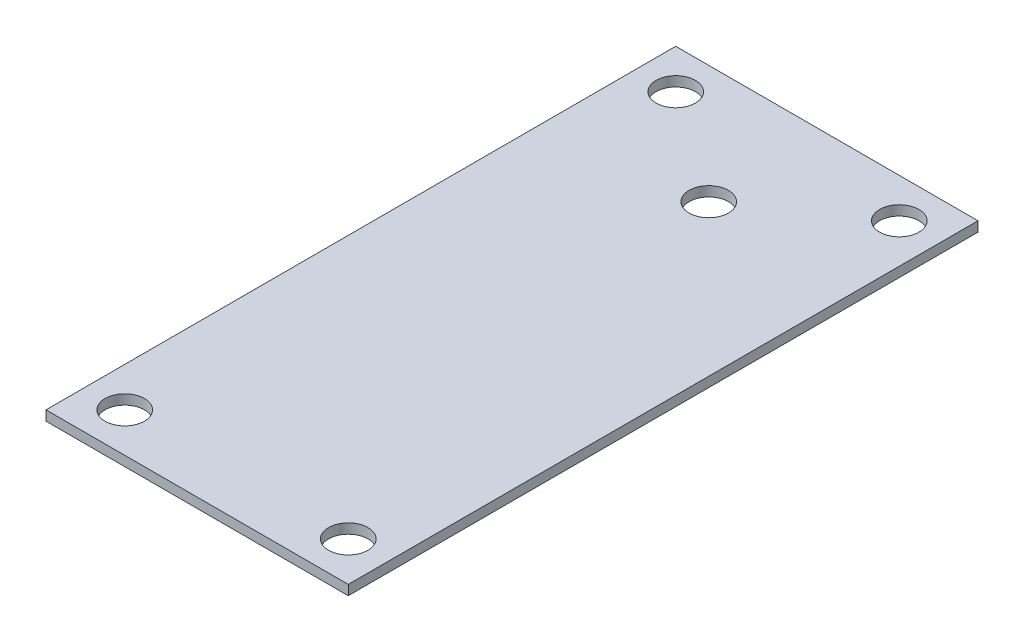
ISO-10303-21;
HEADER;
FILE_DESCRIPTION(('STEP AP214'),'2;1');
FILE_NAME('part.step','',(''),(''),'','','');
FILE_SCHEMA(('AUTOMOTIVE_DESIGN { 1 0 10303 214 1 1 1 1 }'));
ENDSEC;
DATA;
#1=APPLICATION_CONTEXT('core data for automotive mechanical design processes');
#2=APPLICATION_PROTOCOL_DEFINITION('international standard','automotive_design',2000,#1);
#3=PRODUCT_CONTEXT('',#1,'mechanical');
#4=PRODUCT('Part','Part','',(#3));
#5=PRODUCT_RELATED_PRODUCT_CATEGORY('part','',(#4));
#6=PRODUCT_DEFINITION_FORMATION('','',#4);
#7=PRODUCT_DEFINITION_CONTEXT('part definition',#1,'design');
#8=PRODUCT_DEFINITION('design','',#6,#7);
#9=PRODUCT_DEFINITION_SHAPE('','',#8);
#10=(LENGTH_UNIT() NAMED_UNIT(*) SI_UNIT(.MILLI.,.METRE.));
#11=(NAMED_UNIT(*) PLANE_ANGLE_UNIT() SI_UNIT($,.RADIAN.));
#12=(NAMED_UNIT(*) SI_UNIT($,.STERADIAN.) SOLID_ANGLE_UNIT());
#13=UNCERTAINTY_MEASURE_WITH_UNIT(LENGTH_MEASURE(1.E-05),#10,'distance_accuracy_value','');
#14=(GEOMETRIC_REPRESENTATION_CONTEXT(3) GLOBAL_UNCERTAINTY_ASSIGNED_CONTEXT((#13)) GLOBAL_UNIT_ASSIGNED_CONTEXT((#10,
#11,#12)) REPRESENTATION_CONTEXT('',''));
#15=CARTESIAN_POINT('',(0.,0.,0.));
#16=DIRECTION('',(0.,0.,1.));
#17=DIRECTION('',(1.,0.,0.));
#18=AXIS2_PLACEMENT_3D('',#15,#16,#17);
#19=CARTESIAN_POINT('',(0.,1.5875,-50.8));
#20=DIRECTION('',(0.,0.,-1.));
#21=DIRECTION('',(-1.,0.,0.));
#22=AXIS2_PLACEMENT_3D('',#19,#20,#21);
#23=PLANE('',#22);
#24=DIRECTION('',(1.,0.,0.));
#25=VECTOR('',#24,1.);
#26=CARTESIAN_POINT('',(0.,0.,-50.8));
#27=LINE('',#26,#25);
#28=CARTESIAN_POINT('',(-24.384,0.,-50.8));
#29=VERTEX_POINT('',#28);
#30=CARTESIAN_POINT('',(24.384,0.,-50.8));
#31=VERTEX_POINT('',#30);
#32=EDGE_CURVE('E116',#29,#31,#27,.T.);
#33=ORIENTED_EDGE('',*,*,#32,.F.);
#34=DIRECTION('',(0.,-1.,0.));
#35=VECTOR('',#34,1.);
#36=CARTESIAN_POINT('',(-24.384,1.5875,-50.8));
#37=LINE('',#36,#35);
#38=CARTESIAN_POINT('',(-24.384,1.5875,-50.8));
#39=VERTEX_POINT('',#38);
#40=EDGE_CURVE('E74',#39,#29,#37,.T.);
#41=ORIENTED_EDGE('',*,*,#40,.F.);
#42=DIRECTION('',(1.,0.,0.));
#43=VECTOR('',#42,1.);
#44=CARTESIAN_POINT('',(0.,1.5875,-50.8));
#45=LINE('',#44,#43);
#46=CARTESIAN_POINT('',(24.384,1.5875,-50.8));
#47=VERTEX_POINT('',#46);
#48=EDGE_CURVE('E114',#39,#47,#45,.T.);
#49=ORIENTED_EDGE('',*,*,#48,.T.);
#50=DIRECTION('',(0.,-1.,0.));
#51=VECTOR('',#50,1.);
#52=CARTESIAN_POINT('',(24.384,1.5875,-50.8));
#53=LINE('',#52,#51);
#54=EDGE_CURVE('E12',#47,#31,#53,.T.);
#55=ORIENTED_EDGE('',*,*,#54,.T.);
#56=EDGE_LOOP('',(#33,#41,#49,#55));
#57=FACE_BOUND('',#56,.T.);
#58=ADVANCED_FACE('F65',(#57),#23,.T.);
#59=CARTESIAN_POINT('',(-24.384,1.5875,0.));
#60=DIRECTION('',(1.,0.,0.));
#61=DIRECTION('',(0.,0.,-1.));
#62=AXIS2_PLACEMENT_3D('',#59,#60,#61);
#63=PLANE('',#62);
#64=DIRECTION('',(0.,0.,1.));
#65=VECTOR('',#64,1.);
#66=CARTESIAN_POINT('',(-24.384,0.,0.));
#67=LINE('',#66,#65);
#68=CARTESIAN_POINT('',(-24.384,0.,50.8));
#69=VERTEX_POINT('',#68);
#70=EDGE_CURVE('E148',#29,#69,#67,.T.);
#71=ORIENTED_EDGE('',*,*,#70,.T.);
#72=DIRECTION('',(0.,-1.,0.));
#73=VECTOR('',#72,1.);
#74=CARTESIAN_POINT('',(-24.384,1.5875,50.8));
#75=LINE('',#74,#73);
#76=CARTESIAN_POINT('',(-24.384,1.5875,50.8));
#77=VERTEX_POINT('',#76);
#78=EDGE_CURVE('E119',#77,#69,#75,.T.);
#79=ORIENTED_EDGE('',*,*,#78,.F.);
#80=DIRECTION('',(0.,0.,1.));
#81=VECTOR('',#80,1.);
#82=CARTESIAN_POINT('',(-24.384,1.5875,0.));
#83=LINE('',#82,#81);
#84=EDGE_CURVE('E121',#39,#77,#83,.T.);
#85=ORIENTED_EDGE('',*,*,#84,.F.);
#86=ORIENTED_EDGE('',*,*,#40,.T.);
#87=EDGE_LOOP('',(#71,#79,#85,#86));
#88=FACE_BOUND('',#87,.T.);
#89=ADVANCED_FACE('F122',(#88),#63,.F.);
#90=CARTESIAN_POINT('',(0.,1.5875,50.8));
#91=DIRECTION('',(0.,0.,-1.));
#92=DIRECTION('',(-1.,0.,0.));
#93=AXIS2_PLACEMENT_3D('',#90,#91,#92);
#94=PLANE('',#93);
#95=DIRECTION('',(1.,0.,0.));
#96=VECTOR('',#95,1.);
#97=CARTESIAN_POINT('',(0.,0.,50.8));
#98=LINE('',#97,#96);
#99=CARTESIAN_POINT('',(24.384,0.,50.8));
#100=VERTEX_POINT('',#99);
#101=EDGE_CURVE('E98',#69,#100,#98,.T.);
#102=ORIENTED_EDGE('',*,*,#101,.T.);
#103=DIRECTION('',(0.,-1.,0.));
#104=VECTOR('',#103,1.);
#105=CARTESIAN_POINT('',(24.384,1.5875,50.8));
#106=LINE('',#105,#104);
#107=CARTESIAN_POINT('',(24.384,1.5875,50.8));
#108=VERTEX_POINT('',#107);
#109=EDGE_CURVE('E105',#108,#100,#106,.T.);
#110=ORIENTED_EDGE('',*,*,#109,.F.);
#111=DIRECTION('',(1.,0.,0.));
#112=VECTOR('',#111,1.);
#113=CARTESIAN_POINT('',(0.,1.5875,50.8));
#114=LINE('',#113,#112);
#115=EDGE_CURVE('E82',#77,#108,#114,.T.);
#116=ORIENTED_EDGE('',*,*,#115,.F.);
#117=ORIENTED_EDGE('',*,*,#78,.T.);
#118=EDGE_LOOP('',(#102,#110,#116,#117));
#119=FACE_BOUND('',#118,.T.);
#120=ADVANCED_FACE('F154',(#119),#94,.F.);
#121=CARTESIAN_POINT('',(24.384,1.5875,0.));
#122=DIRECTION('',(1.,0.,0.));
#123=DIRECTION('',(0.,0.,-1.));
#124=AXIS2_PLACEMENT_3D('',#121,#122,#123);
#125=PLANE('',#124);
#126=DIRECTION('',(0.,0.,1.));
#127=VECTOR('',#126,1.);
#128=CARTESIAN_POINT('',(24.384,0.,0.));
#129=LINE('',#128,#127);
#130=EDGE_CURVE('E145',#31,#100,#129,.T.);
#131=ORIENTED_EDGE('',*,*,#130,.F.);
#132=ORIENTED_EDGE('',*,*,#54,.F.);
#133=DIRECTION('',(0.,0.,1.));
#134=VECTOR('',#133,1.);
#135=CARTESIAN_POINT('',(24.384,1.5875,0.));
#136=LINE('',#135,#134);
#137=EDGE_CURVE('E125',#47,#108,#136,.T.);
#138=ORIENTED_EDGE('',*,*,#137,.T.);
#139=ORIENTED_EDGE('',*,*,#109,.T.);
#140=EDGE_LOOP('',(#131,#132,#138,#139));
#141=FACE_BOUND('',#140,.T.);
#142=ADVANCED_FACE('F156',(#141),#125,.T.);
#143=CARTESIAN_POINT('',(-18.034,1.5875,-44.45));
#144=DIRECTION('',(0.,-1.,0.));
#145=DIRECTION('',(0.,0.,-1.));
#146=AXIS2_PLACEMENT_3D('',#143,#144,#145);
#147=CYLINDRICAL_SURFACE('',#146,3.175);
#148=CARTESIAN_POINT('',(-18.034,1.5875,-44.45));
#149=DIRECTION('',(0.,1.,0.));
#150=DIRECTION('',(0.,0.,1.));
#151=AXIS2_PLACEMENT_3D('',#148,#149,#150);
#152=CIRCLE('',#151,3.175);
#153=CARTESIAN_POINT('',(-18.034,1.5875,-41.275));
#154=VERTEX_POINT('',#153);
#155=EDGE_CURVE('E127',#154,#154,#152,.T.);
#156=ORIENTED_EDGE('',*,*,#155,.T.);
#157=EDGE_LOOP('',(#156));
#158=FACE_BOUND('',#157,.T.);
#159=CARTESIAN_POINT('',(-18.034,0.,-44.45));
#160=DIRECTION('',(0.,1.,0.));
#161=DIRECTION('',(0.,0.,1.));
#162=AXIS2_PLACEMENT_3D('',#159,#160,#161);
#163=CIRCLE('',#162,3.175);
#164=CARTESIAN_POINT('',(-18.034,0.,-41.275));
#165=VERTEX_POINT('',#164);
#166=EDGE_CURVE('E142',#165,#165,#163,.T.);
#167=ORIENTED_EDGE('',*,*,#166,.F.);
#168=EDGE_LOOP('',(#167));
#169=FACE_BOUND('',#168,.T.);
#170=ADVANCED_FACE('F158',(#158,#169),#147,.F.);
#171=CARTESIAN_POINT('',(18.034,1.5875,-44.45));
#172=DIRECTION('',(0.,-1.,0.));
#173=DIRECTION('',(0.,0.,-1.));
#174=AXIS2_PLACEMENT_3D('',#171,#172,#173);
#175=CYLINDRICAL_SURFACE('',#174,3.175);
#176=CARTESIAN_POINT('',(18.034,1.5875,-44.45));
#177=DIRECTION('',(0.,1.,0.));
#178=DIRECTION('',(0.,0.,1.));
#179=AXIS2_PLACEMENT_3D('',#176,#177,#178);
#180=CIRCLE('',#179,3.175);
#181=CARTESIAN_POINT('',(18.034,1.5875,-41.275));
#182=VERTEX_POINT('',#181);
#183=EDGE_CURVE('E200',#182,#182,#180,.T.);
#184=ORIENTED_EDGE('',*,*,#183,.T.);
#185=EDGE_LOOP('',(#184));
#186=FACE_BOUND('',#185,.T.);
#187=CARTESIAN_POINT('',(18.034,0.,-44.45));
#188=DIRECTION('',(0.,1.,0.));
#189=DIRECTION('',(0.,0.,1.));
#190=AXIS2_PLACEMENT_3D('',#187,#188,#189);
#191=CIRCLE('',#190,3.175);
#192=CARTESIAN_POINT('',(18.034,0.,-41.275));
#193=VERTEX_POINT('',#192);
#194=EDGE_CURVE('E139',#193,#193,#191,.T.);
#195=ORIENTED_EDGE('',*,*,#194,.F.);
#196=EDGE_LOOP('',(#195));
#197=FACE_BOUND('',#196,.T.);
#198=ADVANCED_FACE('F164',(#186,#197),#175,.F.);
#199=CARTESIAN_POINT('',(18.034,1.5875,44.45));
#200=DIRECTION('',(0.,-1.,0.));
#201=DIRECTION('',(0.,0.,-1.));
#202=AXIS2_PLACEMENT_3D('',#199,#200,#201);
#203=CYLINDRICAL_SURFACE('',#202,3.175);
#204=CARTESIAN_POINT('',(18.034,1.5875,44.45));
#205=DIRECTION('',(0.,1.,0.));
#206=DIRECTION('',(0.,0.,1.));
#207=AXIS2_PLACEMENT_3D('',#204,#205,#206);
#208=CIRCLE('',#207,3.175);
#209=CARTESIAN_POINT('',(18.034,1.5875,47.625));
#210=VERTEX_POINT('',#209);
#211=EDGE_CURVE('E197',#210,#210,#208,.T.);
#212=ORIENTED_EDGE('',*,*,#211,.T.);
#213=EDGE_LOOP('',(#212));
#214=FACE_BOUND('',#213,.T.);
#215=CARTESIAN_POINT('',(18.034,0.,44.45));
#216=DIRECTION('',(0.,1.,0.));
#217=DIRECTION('',(0.,0.,1.));
#218=AXIS2_PLACEMENT_3D('',#215,#216,#217);
#219=CIRCLE('',#218,3.175);
#220=CARTESIAN_POINT('',(18.034,0.,47.625));
#221=VERTEX_POINT('',#220);
#222=EDGE_CURVE('E135',#221,#221,#219,.T.);
#223=ORIENTED_EDGE('',*,*,#222,.F.);
#224=EDGE_LOOP('',(#223));
#225=FACE_BOUND('',#224,.T.);
#226=ADVANCED_FACE('F213',(#214,#225),#203,.F.);
#227=CARTESIAN_POINT('',(-18.034,1.5875,44.45));
#228=DIRECTION('',(0.,-1.,0.));
#229=DIRECTION('',(0.,0.,-1.));
#230=AXIS2_PLACEMENT_3D('',#227,#228,#229);
#231=CYLINDRICAL_SURFACE('',#230,3.175);
#232=CARTESIAN_POINT('',(-18.034,1.5875,44.45));
#233=DIRECTION('',(0.,1.,0.));
#234=DIRECTION('',(0.,0.,1.));
#235=AXIS2_PLACEMENT_3D('',#232,#233,#234);
#236=CIRCLE('',#235,3.175);
#237=CARTESIAN_POINT('',(-18.034,1.5875,47.625));
#238=VERTEX_POINT('',#237);
#239=EDGE_CURVE('E151',#238,#238,#236,.T.);
#240=ORIENTED_EDGE('',*,*,#239,.T.);
#241=EDGE_LOOP('',(#240));
#242=FACE_BOUND('',#241,.T.);
#243=CARTESIAN_POINT('',(-18.034,0.,44.45));
#244=DIRECTION('',(0.,1.,0.));
#245=DIRECTION('',(0.,0.,1.));
#246=AXIS2_PLACEMENT_3D('',#243,#244,#245);
#247=CIRCLE('',#246,3.175);
#248=CARTESIAN_POINT('',(-18.034,0.,47.625));
#249=VERTEX_POINT('',#248);
#250=EDGE_CURVE('E132',#249,#249,#247,.T.);
#251=ORIENTED_EDGE('',*,*,#250,.F.);
#252=EDGE_LOOP('',(#251));
#253=FACE_BOUND('',#252,.T.);
#254=ADVANCED_FACE('F67',(#242,#253),#231,.F.);
#255=CARTESIAN_POINT('',(0.,0.,0.));
#256=DIRECTION('',(0.,1.,0.));
#257=DIRECTION('',(0.,0.,1.));
#258=AXIS2_PLACEMENT_3D('',#255,#256,#257);
#259=PLANE('',#258);
#260=CARTESIAN_POINT('',(0.,0.,-31.75));
#261=DIRECTION('',(0.,1.,0.));
#262=DIRECTION('',(0.,0.,1.));
#263=AXIS2_PLACEMENT_3D('',#260,#261,#262);
#264=CIRCLE('',#263,3.175);
#265=CARTESIAN_POINT('',(0.,0.,-28.575));
#266=VERTEX_POINT('',#265);
#267=EDGE_CURVE('E136',#266,#266,#264,.F.);
#268=ORIENTED_EDGE('',*,*,#267,.F.);
#269=EDGE_LOOP('',(#268));
#270=FACE_BOUND('',#269,.T.);
#271=ORIENTED_EDGE('',*,*,#250,.T.);
#272=EDGE_LOOP('',(#271));
#273=FACE_BOUND('',#272,.T.);
#274=ORIENTED_EDGE('',*,*,#222,.T.);
#275=EDGE_LOOP('',(#274));
#276=FACE_BOUND('',#275,.T.);
#277=ORIENTED_EDGE('',*,*,#194,.T.);
#278=EDGE_LOOP('',(#277));
#279=FACE_BOUND('',#278,.T.);
#280=ORIENTED_EDGE('',*,*,#166,.T.);
#281=EDGE_LOOP('',(#280));
#282=FACE_BOUND('',#281,.T.);
#283=ORIENTED_EDGE('',*,*,#130,.T.);
#284=ORIENTED_EDGE('',*,*,#101,.F.);
#285=ORIENTED_EDGE('',*,*,#70,.F.);
#286=ORIENTED_EDGE('',*,*,#32,.T.);
#287=EDGE_LOOP('',(#283,#284,#285,#286));
#288=FACE_BOUND('',#287,.T.);
#289=ADVANCED_FACE('F155',(#270,#273,#276,#279,#282,#288),#259,.F.);
#290=CARTESIAN_POINT('',(0.,1.5875,0.));
#291=DIRECTION('',(0.,1.,0.));
#292=DIRECTION('',(0.,0.,1.));
#293=AXIS2_PLACEMENT_3D('',#290,#291,#292);
#294=PLANE('',#293);
#295=CARTESIAN_POINT('',(0.,1.5875,-31.75));
#296=DIRECTION('',(0.,1.,0.));
#297=DIRECTION('',(0.,0.,1.));
#298=AXIS2_PLACEMENT_3D('',#295,#296,#297);
#299=CIRCLE('',#298,3.175);
#300=CARTESIAN_POINT('',(0.,1.5875,-28.575));
#301=VERTEX_POINT('',#300);
#302=EDGE_CURVE('E189',#301,#301,#299,.T.);
#303=ORIENTED_EDGE('',*,*,#302,.F.);
#304=EDGE_LOOP('',(#303));
#305=FACE_BOUND('',#304,.T.);
#306=ORIENTED_EDGE('',*,*,#239,.F.);
#307=EDGE_LOOP('',(#306));
#308=FACE_BOUND('',#307,.T.);
#309=ORIENTED_EDGE('',*,*,#211,.F.);
#310=EDGE_LOOP('',(#309));
#311=FACE_BOUND('',#310,.T.);
#312=ORIENTED_EDGE('',*,*,#183,.F.);
#313=EDGE_LOOP('',(#312));
#314=FACE_BOUND('',#313,.T.);
#315=ORIENTED_EDGE('',*,*,#155,.F.);
#316=EDGE_LOOP('',(#315));
#317=FACE_BOUND('',#316,.T.);
#318=ORIENTED_EDGE('',*,*,#137,.F.);
#319=ORIENTED_EDGE('',*,*,#48,.F.);
#320=ORIENTED_EDGE('',*,*,#84,.T.);
#321=ORIENTED_EDGE('',*,*,#115,.T.);
#322=EDGE_LOOP('',(#318,#319,#320,#321));
#323=FACE_BOUND('',#322,.T.);
#324=ADVANCED_FACE('F124',(#305,#308,#311,#314,#317,#323),#294,.T.);
#325=CARTESIAN_POINT('',(0.,-0.000999999999999916,-31.75));
#326=DIRECTION('',(0.,1.,0.));
#327=DIRECTION('',(0.,0.,1.));
#328=AXIS2_PLACEMENT_3D('',#325,#326,#327);
#329=CYLINDRICAL_SURFACE('',#328,3.175);
#330=ORIENTED_EDGE('',*,*,#302,.T.);
#331=EDGE_LOOP('',(#330));
#332=FACE_BOUND('',#331,.T.);
#333=ORIENTED_EDGE('',*,*,#267,.T.);
#334=EDGE_LOOP('',(#333));
#335=FACE_BOUND('',#334,.T.);
#336=ADVANCED_FACE('F180',(#332,#335),#329,.F.);
#337=CLOSED_SHELL('',(#58,#89,#120,#142,#170,#198,#226,#254,#289,#324,#336));
#338=MANIFOLD_SOLID_BREP('B2',#337);
#339=ADVANCED_BREP_SHAPE_REPRESENTATION('',(#18,#338),#14);
#340=SHAPE_DEFINITION_REPRESENTATION(#9,#339);
ENDSEC;
END-ISO-10303-21;
